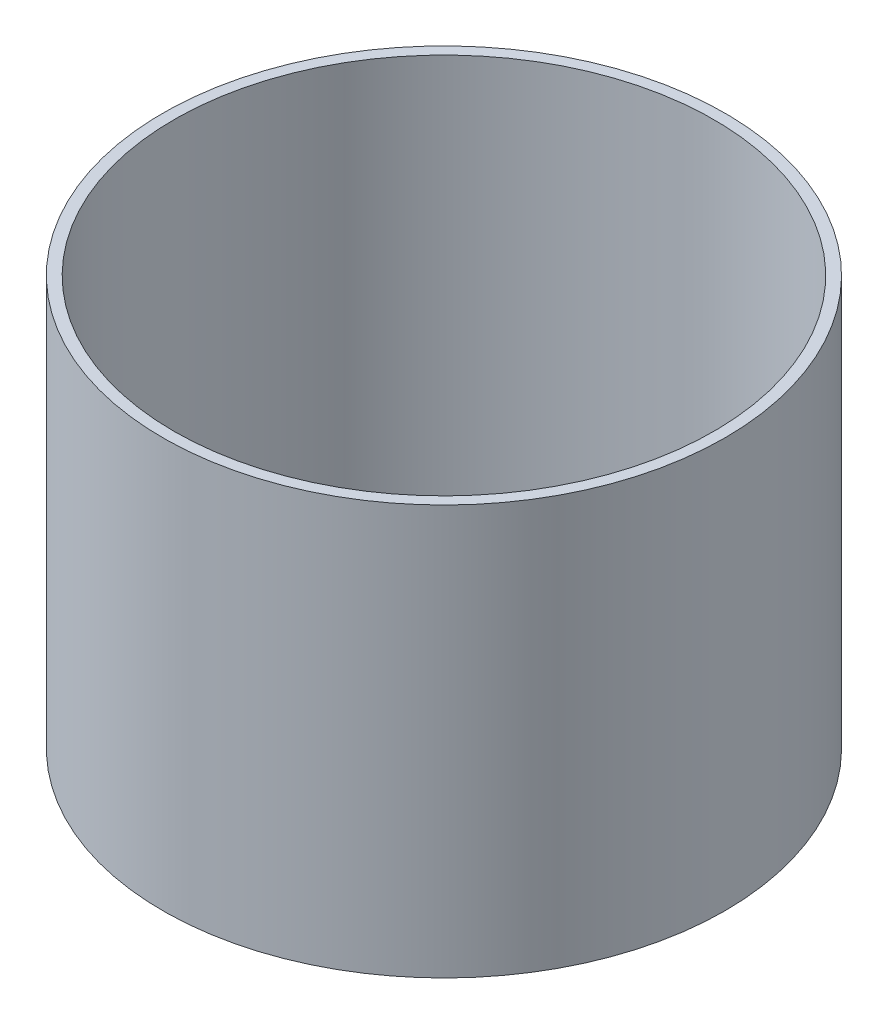
ISO-10303-21;
HEADER;
FILE_DESCRIPTION(('STEP AP214'),'2;1');
FILE_NAME('part.step','',(''),(''),'','','');
FILE_SCHEMA(('AUTOMOTIVE_DESIGN { 1 0 10303 214 1 1 1 1 }'));
ENDSEC;
DATA;
#1=APPLICATION_CONTEXT('core data for automotive mechanical design processes');
#2=APPLICATION_PROTOCOL_DEFINITION('international standard','automotive_design',2000,#1);
#3=PRODUCT_CONTEXT('',#1,'mechanical');
#4=PRODUCT('Part','Part','',(#3));
#5=PRODUCT_RELATED_PRODUCT_CATEGORY('part','',(#4));
#6=PRODUCT_DEFINITION_FORMATION('','',#4);
#7=PRODUCT_DEFINITION_CONTEXT('part definition',#1,'design');
#8=PRODUCT_DEFINITION('design','',#6,#7);
#9=PRODUCT_DEFINITION_SHAPE('','',#8);
#10=(LENGTH_UNIT() NAMED_UNIT(*) SI_UNIT(.MILLI.,.METRE.));
#11=(NAMED_UNIT(*) PLANE_ANGLE_UNIT() SI_UNIT($,.RADIAN.));
#12=(NAMED_UNIT(*) SI_UNIT($,.STERADIAN.) SOLID_ANGLE_UNIT());
#13=UNCERTAINTY_MEASURE_WITH_UNIT(LENGTH_MEASURE(1.E-05),#10,'distance_accuracy_value','');
#14=(GEOMETRIC_REPRESENTATION_CONTEXT(3) GLOBAL_UNCERTAINTY_ASSIGNED_CONTEXT((#13)) GLOBAL_UNIT_ASSIGNED_CONTEXT((#10,
#11,#12)) REPRESENTATION_CONTEXT('',''));
#15=CARTESIAN_POINT('',(0.,0.,0.));
#16=DIRECTION('',(0.,0.,1.));
#17=DIRECTION('',(1.,0.,0.));
#18=AXIS2_PLACEMENT_3D('',#15,#16,#17);
#19=CARTESIAN_POINT('',(0.,279.4,0.));
#20=DIRECTION('',(0.,1.,0.));
#21=DIRECTION('',(0.,0.,1.));
#22=AXIS2_PLACEMENT_3D('',#19,#20,#21);
#23=PLANE('',#22);
#24=CARTESIAN_POINT('',(0.,279.4,0.));
#25=DIRECTION('',(0.,1.,0.));
#26=DIRECTION('',(1.,0.,0.));
#27=AXIS2_PLACEMENT_3D('',#24,#25,#26);
#28=CIRCLE('',#27,191.77);
#29=CARTESIAN_POINT('',(191.77,279.4,0.));
#30=VERTEX_POINT('',#29);
#31=EDGE_CURVE('E11',#30,#30,#28,.T.);
#32=ORIENTED_EDGE('',*,*,#31,.T.);
#33=EDGE_LOOP('',(#32));
#34=FACE_BOUND('',#33,.T.);
#35=CARTESIAN_POINT('',(0.,279.4,0.));
#36=DIRECTION('',(0.,1.,0.));
#37=DIRECTION('',(0.,0.,1.));
#38=AXIS2_PLACEMENT_3D('',#35,#36,#37);
#39=CIRCLE('',#38,184.15);
#40=CARTESIAN_POINT('',(0.,279.4,184.15));
#41=VERTEX_POINT('',#40);
#42=EDGE_CURVE('E60',#41,#41,#39,.T.);
#43=ORIENTED_EDGE('',*,*,#42,.F.);
#44=EDGE_LOOP('',(#43));
#45=FACE_BOUND('',#44,.T.);
#46=ADVANCED_FACE('F47',(#34,#45),#23,.T.);
#47=CARTESIAN_POINT('',(0.,0.,0.));
#48=DIRECTION('',(0.,1.,0.));
#49=DIRECTION('',(0.,0.,1.));
#50=AXIS2_PLACEMENT_3D('',#47,#48,#49);
#51=PLANE('',#50);
#52=CARTESIAN_POINT('',(0.,0.,0.));
#53=DIRECTION('',(0.,1.,0.));
#54=DIRECTION('',(1.,0.,0.));
#55=AXIS2_PLACEMENT_3D('',#52,#53,#54);
#56=CIRCLE('',#55,191.77);
#57=CARTESIAN_POINT('',(191.77,0.,0.));
#58=VERTEX_POINT('',#57);
#59=EDGE_CURVE('E51',#58,#58,#56,.T.);
#60=ORIENTED_EDGE('',*,*,#59,.F.);
#61=EDGE_LOOP('',(#60));
#62=FACE_BOUND('',#61,.T.);
#63=CARTESIAN_POINT('',(0.,0.,0.));
#64=DIRECTION('',(0.,1.,0.));
#65=DIRECTION('',(0.,0.,1.));
#66=AXIS2_PLACEMENT_3D('',#63,#64,#65);
#67=CIRCLE('',#66,184.15);
#68=CARTESIAN_POINT('',(0.,0.,184.15));
#69=VERTEX_POINT('',#68);
#70=EDGE_CURVE('E62',#69,#69,#67,.T.);
#71=ORIENTED_EDGE('',*,*,#70,.T.);
#72=EDGE_LOOP('',(#71));
#73=FACE_BOUND('',#72,.T.);
#74=ADVANCED_FACE('F74',(#62,#73),#51,.F.);
#75=CARTESIAN_POINT('',(0.,279.4,0.));
#76=DIRECTION('',(0.,-1.,0.));
#77=DIRECTION('',(0.,0.,-1.));
#78=AXIS2_PLACEMENT_3D('',#75,#76,#77);
#79=CYLINDRICAL_SURFACE('',#78,191.77);
#80=ORIENTED_EDGE('',*,*,#31,.F.);
#81=EDGE_LOOP('',(#80));
#82=FACE_BOUND('',#81,.T.);
#83=ORIENTED_EDGE('',*,*,#59,.T.);
#84=EDGE_LOOP('',(#83));
#85=FACE_BOUND('',#84,.T.);
#86=ADVANCED_FACE('F49',(#82,#85),#79,.T.);
#87=CARTESIAN_POINT('',(0.,279.4,0.));
#88=DIRECTION('',(0.,-1.,0.));
#89=DIRECTION('',(0.,0.,-1.));
#90=AXIS2_PLACEMENT_3D('',#87,#88,#89);
#91=CYLINDRICAL_SURFACE('',#90,184.15);
#92=ORIENTED_EDGE('',*,*,#42,.T.);
#93=EDGE_LOOP('',(#92));
#94=FACE_BOUND('',#93,.T.);
#95=ORIENTED_EDGE('',*,*,#70,.F.);
#96=EDGE_LOOP('',(#95));
#97=FACE_BOUND('',#96,.T.);
#98=ADVANCED_FACE('F70',(#94,#97),#91,.F.);
#99=CLOSED_SHELL('',(#46,#74,#86,#98));
#100=MANIFOLD_SOLID_BREP('B2',#99);
#101=ADVANCED_BREP_SHAPE_REPRESENTATION('',(#18,#100),#14);
#102=SHAPE_DEFINITION_REPRESENTATION(#9,#101);
ENDSEC;
END-ISO-10303-21;
